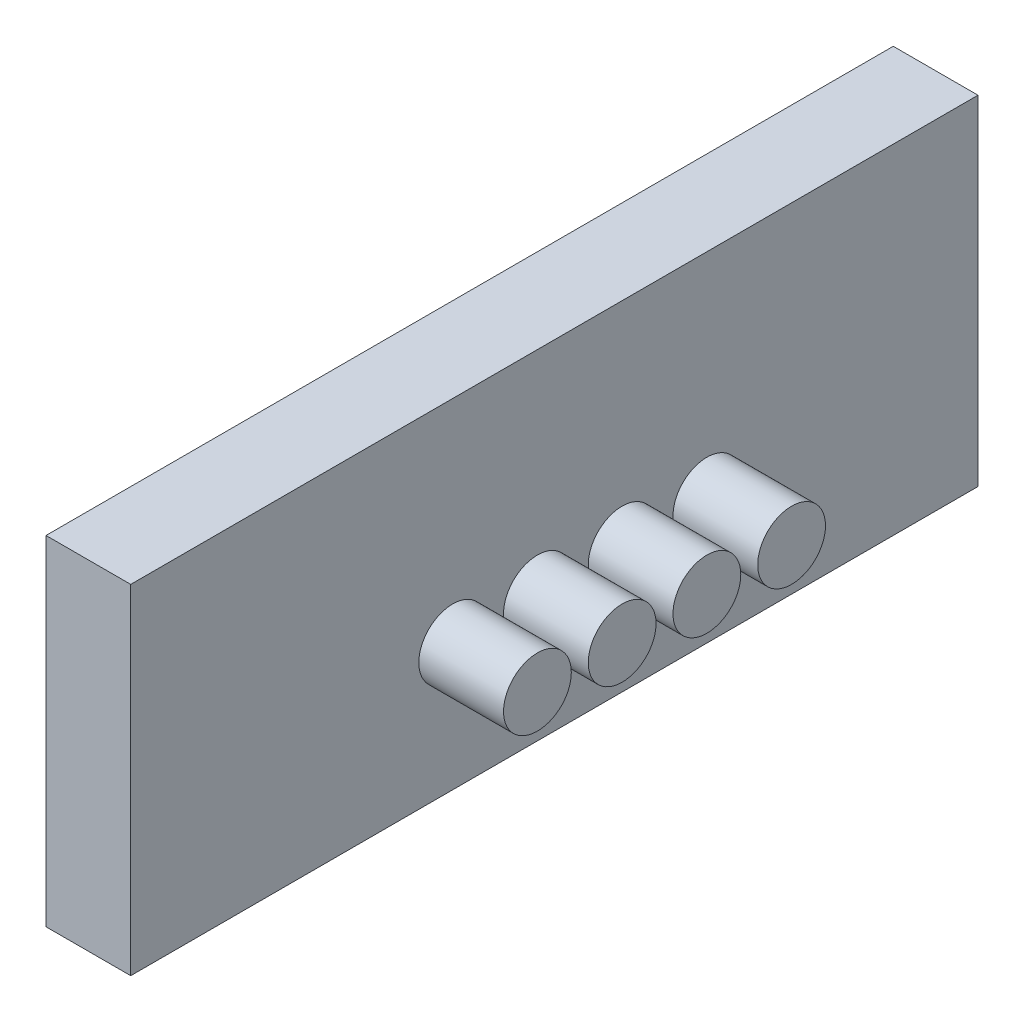
ISO-10303-21;
HEADER;
FILE_DESCRIPTION(('STEP AP214'),'2;1');
FILE_NAME('part.step','',(''),(''),'','','');
FILE_SCHEMA(('AUTOMOTIVE_DESIGN { 1 0 10303 214 1 1 1 1 }'));
ENDSEC;
DATA;
#1=APPLICATION_CONTEXT('core data for automotive mechanical design processes');
#2=APPLICATION_PROTOCOL_DEFINITION('international standard','automotive_design',2000,#1);
#3=PRODUCT_CONTEXT('',#1,'mechanical');
#4=PRODUCT('Part','Part','',(#3));
#5=PRODUCT_RELATED_PRODUCT_CATEGORY('part','',(#4));
#6=PRODUCT_DEFINITION_FORMATION('','',#4);
#7=PRODUCT_DEFINITION_CONTEXT('part definition',#1,'design');
#8=PRODUCT_DEFINITION('design','',#6,#7);
#9=PRODUCT_DEFINITION_SHAPE('','',#8);
#10=(LENGTH_UNIT() NAMED_UNIT(*) SI_UNIT(.MILLI.,.METRE.));
#11=(NAMED_UNIT(*) PLANE_ANGLE_UNIT() SI_UNIT($,.RADIAN.));
#12=(NAMED_UNIT(*) SI_UNIT($,.STERADIAN.) SOLID_ANGLE_UNIT());
#13=UNCERTAINTY_MEASURE_WITH_UNIT(LENGTH_MEASURE(1.E-05),#10,'distance_accuracy_value','');
#14=(GEOMETRIC_REPRESENTATION_CONTEXT(3) GLOBAL_UNCERTAINTY_ASSIGNED_CONTEXT((#13)) GLOBAL_UNIT_ASSIGNED_CONTEXT((#10,
#11,#12)) REPRESENTATION_CONTEXT('',''));
#15=CARTESIAN_POINT('',(0.,0.,0.));
#16=DIRECTION('',(0.,0.,1.));
#17=DIRECTION('',(1.,0.,0.));
#18=AXIS2_PLACEMENT_3D('',#15,#16,#17);
#19=CARTESIAN_POINT('',(0.,0.,0.));
#20=DIRECTION('',(1.,0.,0.));
#21=DIRECTION('',(0.,0.,-1.));
#22=AXIS2_PLACEMENT_3D('',#19,#20,#21);
#23=PLANE('',#22);
#24=DIRECTION('',(0.,-1.,0.));
#25=VECTOR('',#24,1.);
#26=CARTESIAN_POINT('',(0.,-20.,50.));
#27=LINE('',#26,#25);
#28=CARTESIAN_POINT('',(0.,20.,50.));
#29=VERTEX_POINT('',#28);
#30=CARTESIAN_POINT('',(0.,-20.,50.));
#31=VERTEX_POINT('',#30);
#32=EDGE_CURVE('E108',#29,#31,#27,.T.);
#33=ORIENTED_EDGE('',*,*,#32,.F.);
#34=DIRECTION('',(0.,0.,1.));
#35=VECTOR('',#34,1.);
#36=CARTESIAN_POINT('',(0.,20.,-50.));
#37=LINE('',#36,#35);
#38=CARTESIAN_POINT('',(0.,20.,-50.));
#39=VERTEX_POINT('',#38);
#40=EDGE_CURVE('E81',#39,#29,#37,.T.);
#41=ORIENTED_EDGE('',*,*,#40,.F.);
#42=DIRECTION('',(0.,1.,0.));
#43=VECTOR('',#42,1.);
#44=CARTESIAN_POINT('',(0.,-20.,-50.));
#45=LINE('',#44,#43);
#46=CARTESIAN_POINT('',(0.,-20.,-50.));
#47=VERTEX_POINT('',#46);
#48=EDGE_CURVE('E75',#47,#39,#45,.T.);
#49=ORIENTED_EDGE('',*,*,#48,.F.);
#50=DIRECTION('',(0.,0.,-1.));
#51=VECTOR('',#50,1.);
#52=CARTESIAN_POINT('',(0.,-20.,-50.));
#53=LINE('',#52,#51);
#54=EDGE_CURVE('E99',#31,#47,#53,.T.);
#55=ORIENTED_EDGE('',*,*,#54,.F.);
#56=EDGE_LOOP('',(#33,#41,#49,#55));
#57=FACE_BOUND('',#56,.T.);
#58=CARTESIAN_POINT('',(0.,0.,0.));
#59=DIRECTION('',(1.,0.,0.));
#60=DIRECTION('',(0.,0.,-1.));
#61=AXIS2_PLACEMENT_3D('',#58,#59,#60);
#62=CIRCLE('',#61,7.5);
#63=CARTESIAN_POINT('',(0.,0.,-7.50000000000001));
#64=VERTEX_POINT('',#63);
#65=EDGE_CURVE('E11',#64,#64,#62,.F.);
#66=ORIENTED_EDGE('',*,*,#65,.F.);
#67=EDGE_LOOP('',(#66));
#68=FACE_BOUND('',#67,.T.);
#69=ADVANCED_FACE('F40',(#57,#68),#23,.F.);
#70=CARTESIAN_POINT('',(10.,-20.,50.));
#71=DIRECTION('',(0.,0.,-1.));
#72=DIRECTION('',(0.,1.,0.));
#73=AXIS2_PLACEMENT_3D('',#70,#71,#72);
#74=PLANE('',#73);
#75=ORIENTED_EDGE('',*,*,#32,.T.);
#76=DIRECTION('',(-1.,0.,0.));
#77=VECTOR('',#76,1.);
#78=CARTESIAN_POINT('',(10.,-20.,50.));
#79=LINE('',#78,#77);
#80=CARTESIAN_POINT('',(10.,-20.,50.));
#81=VERTEX_POINT('',#80);
#82=EDGE_CURVE('E50',#81,#31,#79,.T.);
#83=ORIENTED_EDGE('',*,*,#82,.F.);
#84=DIRECTION('',(0.,-1.,0.));
#85=VECTOR('',#84,1.);
#86=CARTESIAN_POINT('',(10.,-20.,50.));
#87=LINE('',#86,#85);
#88=CARTESIAN_POINT('',(10.,20.,50.));
#89=VERTEX_POINT('',#88);
#90=EDGE_CURVE('E94',#89,#81,#87,.T.);
#91=ORIENTED_EDGE('',*,*,#90,.F.);
#92=DIRECTION('',(-1.,0.,0.));
#93=VECTOR('',#92,1.);
#94=CARTESIAN_POINT('',(10.,20.,50.));
#95=LINE('',#94,#93);
#96=EDGE_CURVE('E104',#89,#29,#95,.T.);
#97=ORIENTED_EDGE('',*,*,#96,.T.);
#98=EDGE_LOOP('',(#75,#83,#91,#97));
#99=FACE_BOUND('',#98,.T.);
#100=ADVANCED_FACE('F42',(#99),#74,.F.);
#101=CARTESIAN_POINT('',(10.,-20.,-50.));
#102=DIRECTION('',(0.,1.,0.));
#103=DIRECTION('',(0.,0.,1.));
#104=AXIS2_PLACEMENT_3D('',#101,#102,#103);
#105=PLANE('',#104);
#106=ORIENTED_EDGE('',*,*,#54,.T.);
#107=DIRECTION('',(-1.,0.,0.));
#108=VECTOR('',#107,1.);
#109=CARTESIAN_POINT('',(10.,-20.,-50.));
#110=LINE('',#109,#108);
#111=CARTESIAN_POINT('',(10.,-20.,-50.));
#112=VERTEX_POINT('',#111);
#113=EDGE_CURVE('E97',#112,#47,#110,.T.);
#114=ORIENTED_EDGE('',*,*,#113,.F.);
#115=DIRECTION('',(0.,0.,-1.));
#116=VECTOR('',#115,1.);
#117=CARTESIAN_POINT('',(10.,-20.,-50.));
#118=LINE('',#117,#116);
#119=EDGE_CURVE('E89',#81,#112,#118,.T.);
#120=ORIENTED_EDGE('',*,*,#119,.F.);
#121=ORIENTED_EDGE('',*,*,#82,.T.);
#122=EDGE_LOOP('',(#106,#114,#120,#121));
#123=FACE_BOUND('',#122,.T.);
#124=ADVANCED_FACE('F98',(#123),#105,.F.);
#125=CARTESIAN_POINT('',(10.,-20.,-50.));
#126=DIRECTION('',(0.,0.,1.));
#127=DIRECTION('',(1.,0.,0.));
#128=AXIS2_PLACEMENT_3D('',#125,#126,#127);
#129=PLANE('',#128);
#130=ORIENTED_EDGE('',*,*,#48,.T.);
#131=DIRECTION('',(-1.,0.,0.));
#132=VECTOR('',#131,1.);
#133=CARTESIAN_POINT('',(10.,20.,-50.));
#134=LINE('',#133,#132);
#135=CARTESIAN_POINT('',(10.,20.,-50.));
#136=VERTEX_POINT('',#135);
#137=EDGE_CURVE('E100',#136,#39,#134,.T.);
#138=ORIENTED_EDGE('',*,*,#137,.F.);
#139=DIRECTION('',(0.,1.,0.));
#140=VECTOR('',#139,1.);
#141=CARTESIAN_POINT('',(10.,-20.,-50.));
#142=LINE('',#141,#140);
#143=EDGE_CURVE('E92',#112,#136,#142,.T.);
#144=ORIENTED_EDGE('',*,*,#143,.F.);
#145=ORIENTED_EDGE('',*,*,#113,.T.);
#146=EDGE_LOOP('',(#130,#138,#144,#145));
#147=FACE_BOUND('',#146,.T.);
#148=ADVANCED_FACE('F102',(#147),#129,.F.);
#149=CARTESIAN_POINT('',(10.,20.,-50.));
#150=DIRECTION('',(0.,-1.,0.));
#151=DIRECTION('',(0.,0.,-1.));
#152=AXIS2_PLACEMENT_3D('',#149,#150,#151);
#153=PLANE('',#152);
#154=ORIENTED_EDGE('',*,*,#40,.T.);
#155=ORIENTED_EDGE('',*,*,#96,.F.);
#156=DIRECTION('',(0.,0.,1.));
#157=VECTOR('',#156,1.);
#158=CARTESIAN_POINT('',(10.,20.,-50.));
#159=LINE('',#158,#157);
#160=EDGE_CURVE('E58',#136,#89,#159,.T.);
#161=ORIENTED_EDGE('',*,*,#160,.F.);
#162=ORIENTED_EDGE('',*,*,#137,.T.);
#163=EDGE_LOOP('',(#154,#155,#161,#162));
#164=FACE_BOUND('',#163,.T.);
#165=ADVANCED_FACE('F134',(#164),#153,.F.);
#166=CARTESIAN_POINT('',(10.,0.,0.));
#167=DIRECTION('',(1.,0.,0.));
#168=DIRECTION('',(0.,0.,-1.));
#169=AXIS2_PLACEMENT_3D('',#166,#167,#168);
#170=PLANE('',#169);
#171=CARTESIAN_POINT('',(10.,-4.99999999999999,12.));
#172=DIRECTION('',(1.,0.,0.));
#173=DIRECTION('',(0.,0.,-1.));
#174=AXIS2_PLACEMENT_3D('',#171,#172,#173);
#175=CIRCLE('',#174,4.);
#176=CARTESIAN_POINT('',(10.,-4.99999999999999,7.99999999999998));
#177=VERTEX_POINT('',#176);
#178=EDGE_CURVE('E333',#177,#177,#175,.T.);
#179=ORIENTED_EDGE('',*,*,#178,.F.);
#180=EDGE_LOOP('',(#179));
#181=FACE_BOUND('',#180,.T.);
#182=CARTESIAN_POINT('',(10.,-4.99999999999999,1.99999999999998));
#183=DIRECTION('',(1.,0.,0.));
#184=DIRECTION('',(0.,0.,-1.));
#185=AXIS2_PLACEMENT_3D('',#182,#183,#184);
#186=CIRCLE('',#185,4.00000000000001);
#187=CARTESIAN_POINT('',(10.,-4.99999999999999,-2.00000000000002));
#188=VERTEX_POINT('',#187);
#189=EDGE_CURVE('E326',#188,#188,#186,.T.);
#190=ORIENTED_EDGE('',*,*,#189,.F.);
#191=EDGE_LOOP('',(#190));
#192=FACE_BOUND('',#191,.T.);
#193=CARTESIAN_POINT('',(10.,-4.99999999999999,-8.00000000000002));
#194=DIRECTION('',(1.,0.,0.));
#195=DIRECTION('',(0.,0.,-1.));
#196=AXIS2_PLACEMENT_3D('',#193,#194,#195);
#197=CIRCLE('',#196,4.);
#198=CARTESIAN_POINT('',(10.,-4.99999999999999,-12.));
#199=VERTEX_POINT('',#198);
#200=EDGE_CURVE('E330',#199,#199,#197,.T.);
#201=ORIENTED_EDGE('',*,*,#200,.F.);
#202=EDGE_LOOP('',(#201));
#203=FACE_BOUND('',#202,.T.);
#204=CARTESIAN_POINT('',(10.,-4.99999999999999,-18.));
#205=DIRECTION('',(1.,0.,0.));
#206=DIRECTION('',(0.,0.,-1.));
#207=AXIS2_PLACEMENT_3D('',#204,#205,#206);
#208=CIRCLE('',#207,4.00000000000001);
#209=CARTESIAN_POINT('',(10.,-4.99999999999999,-22.));
#210=VERTEX_POINT('',#209);
#211=EDGE_CURVE('E340',#210,#210,#208,.T.);
#212=ORIENTED_EDGE('',*,*,#211,.F.);
#213=EDGE_LOOP('',(#212));
#214=FACE_BOUND('',#213,.T.);
#215=ORIENTED_EDGE('',*,*,#90,.T.);
#216=ORIENTED_EDGE('',*,*,#119,.T.);
#217=ORIENTED_EDGE('',*,*,#143,.T.);
#218=ORIENTED_EDGE('',*,*,#160,.T.);
#219=EDGE_LOOP('',(#215,#216,#217,#218));
#220=FACE_BOUND('',#219,.T.);
#221=ADVANCED_FACE('F90',(#181,#192,#203,#214,#220),#170,.T.);
#222=ORIENTED_EDGE('',*,*,#65,.T.);
#223=EDGE_LOOP('',(#222));
#224=FACE_BOUND('',#223,.T.);
#225=ADVANCED_FACE('F122',(#224),#23,.F.);
#226=CARTESIAN_POINT('',(20.,-4.99999999999999,-18.));
#227=DIRECTION('',(-1.,0.,0.));
#228=DIRECTION('',(0.,0.,1.));
#229=AXIS2_PLACEMENT_3D('',#226,#227,#228);
#230=CYLINDRICAL_SURFACE('',#229,4.00000000000001);
#231=CARTESIAN_POINT('',(20.,-4.99999999999999,-18.));
#232=DIRECTION('',(1.,0.,0.));
#233=DIRECTION('',(0.,0.,-1.));
#234=AXIS2_PLACEMENT_3D('',#231,#232,#233);
#235=CIRCLE('',#234,4.00000000000001);
#236=CARTESIAN_POINT('',(20.,-4.99999999999999,-22.));
#237=VERTEX_POINT('',#236);
#238=EDGE_CURVE('E111',#237,#237,#235,.T.);
#239=ORIENTED_EDGE('',*,*,#238,.F.);
#240=EDGE_LOOP('',(#239));
#241=FACE_BOUND('',#240,.T.);
#242=ORIENTED_EDGE('',*,*,#211,.T.);
#243=EDGE_LOOP('',(#242));
#244=FACE_BOUND('',#243,.T.);
#245=ADVANCED_FACE('F126',(#241,#244),#230,.T.);
#246=CARTESIAN_POINT('',(20.,-4.99999999999999,-18.));
#247=DIRECTION('',(1.,0.,0.));
#248=DIRECTION('',(0.,0.,-1.));
#249=AXIS2_PLACEMENT_3D('',#246,#247,#248);
#250=PLANE('',#249);
#251=ORIENTED_EDGE('',*,*,#238,.T.);
#252=EDGE_LOOP('',(#251));
#253=FACE_BOUND('',#252,.T.);
#254=ADVANCED_FACE('F131',(#253),#250,.T.);
#255=CARTESIAN_POINT('',(20.,-4.99999999999999,-8.00000000000002));
#256=DIRECTION('',(-1.,0.,0.));
#257=DIRECTION('',(0.,0.,1.));
#258=AXIS2_PLACEMENT_3D('',#255,#256,#257);
#259=CYLINDRICAL_SURFACE('',#258,4.);
#260=CARTESIAN_POINT('',(20.,-4.99999999999999,-8.00000000000002));
#261=DIRECTION('',(1.,0.,0.));
#262=DIRECTION('',(0.,0.,-1.));
#263=AXIS2_PLACEMENT_3D('',#260,#261,#262);
#264=CIRCLE('',#263,4.);
#265=CARTESIAN_POINT('',(20.,-4.99999999999999,-12.));
#266=VERTEX_POINT('',#265);
#267=EDGE_CURVE('E337',#266,#266,#264,.T.);
#268=ORIENTED_EDGE('',*,*,#267,.F.);
#269=EDGE_LOOP('',(#268));
#270=FACE_BOUND('',#269,.T.);
#271=ORIENTED_EDGE('',*,*,#200,.T.);
#272=EDGE_LOOP('',(#271));
#273=FACE_BOUND('',#272,.T.);
#274=ADVANCED_FACE('F195',(#270,#273),#259,.T.);
#275=CARTESIAN_POINT('',(20.,-4.99999999999999,-8.00000000000002));
#276=DIRECTION('',(1.,0.,0.));
#277=DIRECTION('',(0.,0.,-1.));
#278=AXIS2_PLACEMENT_3D('',#275,#276,#277);
#279=PLANE('',#278);
#280=ORIENTED_EDGE('',*,*,#267,.T.);
#281=EDGE_LOOP('',(#280));
#282=FACE_BOUND('',#281,.T.);
#283=ADVANCED_FACE('F204',(#282),#279,.T.);
#284=CARTESIAN_POINT('',(20.,-4.99999999999999,1.99999999999998));
#285=DIRECTION('',(-1.,0.,0.));
#286=DIRECTION('',(0.,0.,1.));
#287=AXIS2_PLACEMENT_3D('',#284,#285,#286);
#288=CYLINDRICAL_SURFACE('',#287,4.00000000000001);
#289=CARTESIAN_POINT('',(20.,-4.99999999999999,1.99999999999998));
#290=DIRECTION('',(1.,0.,0.));
#291=DIRECTION('',(0.,0.,-1.));
#292=AXIS2_PLACEMENT_3D('',#289,#290,#291);
#293=CIRCLE('',#292,4.00000000000001);
#294=CARTESIAN_POINT('',(20.,-4.99999999999999,-2.00000000000002));
#295=VERTEX_POINT('',#294);
#296=EDGE_CURVE('E323',#295,#295,#293,.T.);
#297=ORIENTED_EDGE('',*,*,#296,.F.);
#298=EDGE_LOOP('',(#297));
#299=FACE_BOUND('',#298,.T.);
#300=ORIENTED_EDGE('',*,*,#189,.T.);
#301=EDGE_LOOP('',(#300));
#302=FACE_BOUND('',#301,.T.);
#303=ADVANCED_FACE('F209',(#299,#302),#288,.T.);
#304=CARTESIAN_POINT('',(20.,-4.99999999999999,1.99999999999998));
#305=DIRECTION('',(1.,0.,0.));
#306=DIRECTION('',(0.,0.,-1.));
#307=AXIS2_PLACEMENT_3D('',#304,#305,#306);
#308=PLANE('',#307);
#309=ORIENTED_EDGE('',*,*,#296,.T.);
#310=EDGE_LOOP('',(#309));
#311=FACE_BOUND('',#310,.T.);
#312=ADVANCED_FACE('F217',(#311),#308,.T.);
#313=CARTESIAN_POINT('',(20.,-4.99999999999999,12.));
#314=DIRECTION('',(-1.,0.,0.));
#315=DIRECTION('',(0.,0.,1.));
#316=AXIS2_PLACEMENT_3D('',#313,#314,#315);
#317=CYLINDRICAL_SURFACE('',#316,4.);
#318=CARTESIAN_POINT('',(20.,-4.99999999999999,12.));
#319=DIRECTION('',(1.,0.,0.));
#320=DIRECTION('',(0.,0.,-1.));
#321=AXIS2_PLACEMENT_3D('',#318,#319,#320);
#322=CIRCLE('',#321,4.);
#323=CARTESIAN_POINT('',(20.,-4.99999999999999,7.99999999999998));
#324=VERTEX_POINT('',#323);
#325=EDGE_CURVE('E328',#324,#324,#322,.T.);
#326=ORIENTED_EDGE('',*,*,#325,.F.);
#327=EDGE_LOOP('',(#326));
#328=FACE_BOUND('',#327,.T.);
#329=ORIENTED_EDGE('',*,*,#178,.T.);
#330=EDGE_LOOP('',(#329));
#331=FACE_BOUND('',#330,.T.);
#332=ADVANCED_FACE('F222',(#328,#331),#317,.T.);
#333=CARTESIAN_POINT('',(20.,-4.99999999999999,12.));
#334=DIRECTION('',(1.,0.,0.));
#335=DIRECTION('',(0.,0.,-1.));
#336=AXIS2_PLACEMENT_3D('',#333,#334,#335);
#337=PLANE('',#336);
#338=ORIENTED_EDGE('',*,*,#325,.T.);
#339=EDGE_LOOP('',(#338));
#340=FACE_BOUND('',#339,.T.);
#341=ADVANCED_FACE('F229',(#340),#337,.T.);
#342=CLOSED_SHELL('',(#69,#100,#124,#148,#165,#221,#225,#245,#254,#274,#283,#303,#312,#332,#341));
#343=MANIFOLD_SOLID_BREP('B2',#342);
#344=ADVANCED_BREP_SHAPE_REPRESENTATION('',(#18,#343),#14);
#345=SHAPE_DEFINITION_REPRESENTATION(#9,#344);
ENDSEC;
END-ISO-10303-21;
